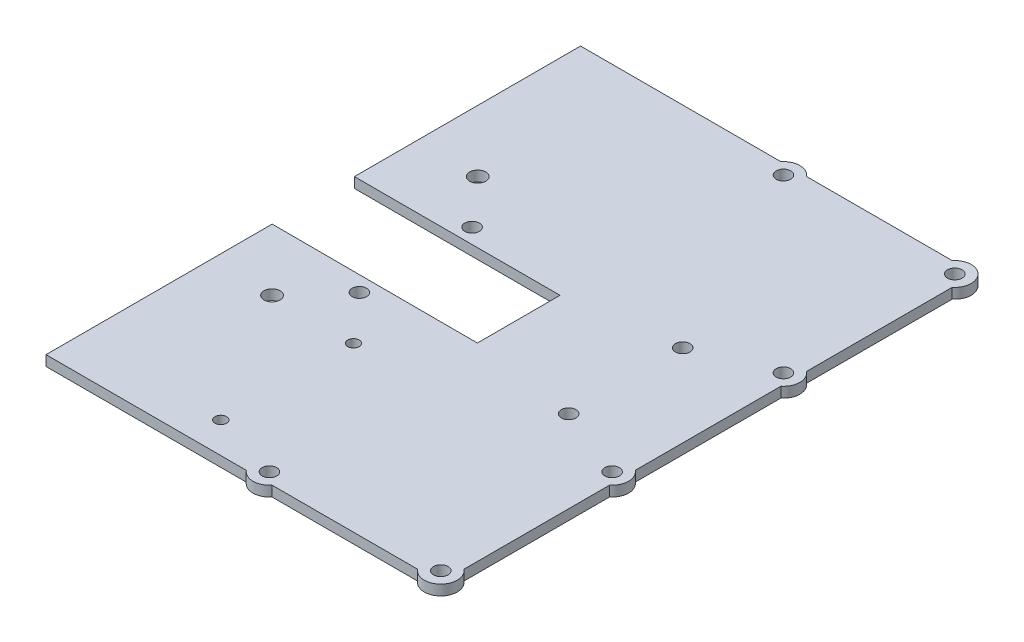
ISO-10303-21;
HEADER;
FILE_DESCRIPTION(('STEP AP214'),'2;1');
FILE_NAME('part.step','',(''),(''),'','','');
FILE_SCHEMA(('AUTOMOTIVE_DESIGN { 1 0 10303 214 1 1 1 1 }'));
ENDSEC;
DATA;
#1=APPLICATION_CONTEXT('core data for automotive mechanical design processes');
#2=APPLICATION_PROTOCOL_DEFINITION('international standard','automotive_design',2000,#1);
#3=PRODUCT_CONTEXT('',#1,'mechanical');
#4=PRODUCT('Part','Part','',(#3));
#5=PRODUCT_RELATED_PRODUCT_CATEGORY('part','',(#4));
#6=PRODUCT_DEFINITION_FORMATION('','',#4);
#7=PRODUCT_DEFINITION_CONTEXT('part definition',#1,'design');
#8=PRODUCT_DEFINITION('design','',#6,#7);
#9=PRODUCT_DEFINITION_SHAPE('','',#8);
#10=(LENGTH_UNIT() NAMED_UNIT(*) SI_UNIT(.MILLI.,.METRE.));
#11=(NAMED_UNIT(*) PLANE_ANGLE_UNIT() SI_UNIT($,.RADIAN.));
#12=(NAMED_UNIT(*) SI_UNIT($,.STERADIAN.) SOLID_ANGLE_UNIT());
#13=UNCERTAINTY_MEASURE_WITH_UNIT(LENGTH_MEASURE(1.E-05),#10,'distance_accuracy_value','');
#14=(GEOMETRIC_REPRESENTATION_CONTEXT(3) GLOBAL_UNCERTAINTY_ASSIGNED_CONTEXT((#13)) GLOBAL_UNIT_ASSIGNED_CONTEXT((#10,
#11,#12)) REPRESENTATION_CONTEXT('',''));
#15=CARTESIAN_POINT('',(0.,0.,0.));
#16=DIRECTION('',(0.,0.,1.));
#17=DIRECTION('',(1.,0.,0.));
#18=AXIS2_PLACEMENT_3D('',#15,#16,#17);
#19=CARTESIAN_POINT('',(65.8400835330666,3.175,-161.924999999998));
#20=DIRECTION('',(0.,1.,0.));
#21=DIRECTION('',(0.,0.,1.));
#22=AXIS2_PLACEMENT_3D('',#19,#20,#21);
#23=PLANE('',#22);
#24=CARTESIAN_POINT('',(44.4499999999973,3.175,-9.52499999999636));
#25=DIRECTION('',(0.,1.,0.));
#26=DIRECTION('',(0.,0.,1.));
#27=AXIS2_PLACEMENT_3D('',#24,#25,#26);
#28=CIRCLE('',#27,1.778);
#29=CARTESIAN_POINT('',(44.4499999999973,3.175,-7.74699999999636));
#30=VERTEX_POINT('',#29);
#31=EDGE_CURVE('E407',#30,#30,#28,.T.);
#32=ORIENTED_EDGE('',*,*,#31,.F.);
#33=EDGE_LOOP('',(#32));
#34=FACE_BOUND('',#33,.T.);
#35=CARTESIAN_POINT('',(44.4499999999973,3.175,-50.5249999999964));
#36=DIRECTION('',(0.,1.,0.));
#37=DIRECTION('',(0.,0.,1.));
#38=AXIS2_PLACEMENT_3D('',#35,#36,#37);
#39=CIRCLE('',#38,1.778);
#40=CARTESIAN_POINT('',(44.4499999999973,3.175,-48.7469999999964));
#41=VERTEX_POINT('',#40);
#42=EDGE_CURVE('E413',#41,#41,#39,.T.);
#43=ORIENTED_EDGE('',*,*,#42,.F.);
#44=EDGE_LOOP('',(#43));
#45=FACE_BOUND('',#44,.T.);
#46=CARTESIAN_POINT('',(19.0500000000007,3.175,-50.7623104410774));
#47=DIRECTION('',(0.,-1.,0.));
#48=DIRECTION('',(0.,0.,-1.));
#49=AXIS2_PLACEMENT_3D('',#46,#47,#48);
#50=CIRCLE('',#49,2.4892);
#51=CARTESIAN_POINT('',(19.0500000000007,3.175,-53.2515104410774));
#52=VERTEX_POINT('',#51);
#53=EDGE_CURVE('E418',#52,#52,#50,.T.);
#54=ORIENTED_EDGE('',*,*,#53,.T.);
#55=EDGE_LOOP('',(#54));
#56=FACE_BOUND('',#55,.T.);
#57=CARTESIAN_POINT('',(31.7125648814911,3.175,-99.8815181228258));
#58=DIRECTION('',(0.,-1.,0.));
#59=DIRECTION('',(0.,0.,1.));
#60=AXIS2_PLACEMENT_3D('',#57,#58,#59);
#61=CIRCLE('',#60,2.24789999999828);
#62=CARTESIAN_POINT('',(31.7125648814911,3.175,-97.6336181228275));
#63=VERTEX_POINT('',#62);
#64=EDGE_CURVE('E426',#63,#63,#61,.T.);
#65=ORIENTED_EDGE('',*,*,#64,.T.);
#66=EDGE_LOOP('',(#65));
#67=FACE_BOUND('',#66,.T.);
#68=CARTESIAN_POINT('',(96.4938906171344,3.175,-100.14870611994));
#69=DIRECTION('',(0.,-1.,0.));
#70=DIRECTION('',(0.,0.,1.));
#71=AXIS2_PLACEMENT_3D('',#68,#69,#70);
#72=CIRCLE('',#71,2.24789999999714);
#73=CARTESIAN_POINT('',(96.4938906171344,3.175,-97.9008061199425));
#74=VERTEX_POINT('',#73);
#75=EDGE_CURVE('E449',#74,#74,#72,.T.);
#76=ORIENTED_EDGE('',*,*,#75,.T.);
#77=EDGE_LOOP('',(#76));
#78=FACE_BOUND('',#77,.T.);
#79=CARTESIAN_POINT('',(96.5317501997383,3.175,-64.8966955716288));
#80=DIRECTION('',(0.,-1.,0.));
#81=DIRECTION('',(0.,0.,-1.));
#82=AXIS2_PLACEMENT_3D('',#79,#80,#81);
#83=CIRCLE('',#82,2.24789999999783);
#84=CARTESIAN_POINT('',(96.5317501997383,3.175,-67.1445955716266));
#85=VERTEX_POINT('',#84);
#86=EDGE_CURVE('E443',#85,#85,#83,.T.);
#87=ORIENTED_EDGE('',*,*,#86,.T.);
#88=EDGE_LOOP('',(#87));
#89=FACE_BOUND('',#88,.T.);
#90=CARTESIAN_POINT('',(31.7499999999973,3.175,-65.0247367825173));
#91=DIRECTION('',(0.,-1.,0.));
#92=DIRECTION('',(0.,0.,-1.));
#93=AXIS2_PLACEMENT_3D('',#90,#91,#92);
#94=CIRCLE('',#93,2.2479000000014);
#95=CARTESIAN_POINT('',(31.7499999999973,3.175,-67.2726367825186));
#96=VERTEX_POINT('',#95);
#97=EDGE_CURVE('E437',#96,#96,#94,.T.);
#98=ORIENTED_EDGE('',*,*,#97,.T.);
#99=EDGE_LOOP('',(#98));
#100=FACE_BOUND('',#99,.T.);
#101=CARTESIAN_POINT('',(19.0500000000007,3.175,-114.3));
#102=DIRECTION('',(0.,-1.,0.));
#103=DIRECTION('',(0.,0.,-1.));
#104=AXIS2_PLACEMENT_3D('',#101,#102,#103);
#105=CIRCLE('',#104,2.4892);
#106=CARTESIAN_POINT('',(19.0500000000007,3.175,-116.7892));
#107=VERTEX_POINT('',#106);
#108=EDGE_CURVE('E425',#107,#107,#105,.T.);
#109=ORIENTED_EDGE('',*,*,#108,.T.);
#110=EDGE_LOOP('',(#109));
#111=FACE_BOUND('',#110,.T.);
#112=CARTESIAN_POINT('',(118.756750199738,3.175,-161.925000000001));
#113=DIRECTION('',(0.,1.,0.));
#114=DIRECTION('',(0.,0.,1.));
#115=AXIS2_PLACEMENT_3D('',#112,#113,#114);
#116=CIRCLE('',#115,2.24789999999733);
#117=CARTESIAN_POINT('',(118.756750199738,3.175,-159.677100000004));
#118=VERTEX_POINT('',#117);
#119=EDGE_CURVE('E460',#118,#118,#116,.T.);
#120=ORIENTED_EDGE('',*,*,#119,.F.);
#121=EDGE_LOOP('',(#120));
#122=FACE_BOUND('',#121,.T.);
#123=CARTESIAN_POINT('',(118.756750199738,3.175,-56.0916666666683));
#124=DIRECTION('',(0.,1.,0.));
#125=DIRECTION('',(0.,0.,1.));
#126=AXIS2_PLACEMENT_3D('',#123,#124,#125);
#127=CIRCLE('',#126,2.24789999999739);
#128=CARTESIAN_POINT('',(118.756750199738,3.175,-53.8437666666709));
#129=VERTEX_POINT('',#128);
#130=EDGE_CURVE('E472',#129,#129,#127,.T.);
#131=ORIENTED_EDGE('',*,*,#130,.F.);
#132=EDGE_LOOP('',(#131));
#133=FACE_BOUND('',#132,.T.);
#134=CARTESIAN_POINT('',(65.8400835330673,3.175,-3.17500000000227));
#135=DIRECTION('',(0.,1.,0.));
#136=DIRECTION('',(0.,0.,1.));
#137=AXIS2_PLACEMENT_3D('',#134,#135,#136);
#138=CIRCLE('',#137,2.2479);
#139=CARTESIAN_POINT('',(65.8400835330673,3.175,-0.927100000002264));
#140=VERTEX_POINT('',#139);
#141=EDGE_CURVE('E197',#140,#140,#138,.T.);
#142=ORIENTED_EDGE('',*,*,#141,.F.);
#143=EDGE_LOOP('',(#142));
#144=FACE_BOUND('',#143,.T.);
#145=CARTESIAN_POINT('',(65.8400835330666,3.175,-161.924999999998));
#146=DIRECTION('',(0.,1.,0.));
#147=DIRECTION('',(0.,0.,1.));
#148=AXIS2_PLACEMENT_3D('',#145,#146,#147);
#149=CIRCLE('',#148,5.08000000000057);
#150=CARTESIAN_POINT('',(69.8056572620526,3.175,-165.099999999995));
#151=VERTEX_POINT('',#150);
#152=CARTESIAN_POINT('',(61.8745098040848,3.175,-165.100000000001));
#153=VERTEX_POINT('',#152);
#154=EDGE_CURVE('E228',#151,#153,#149,.T.);
#155=ORIENTED_EDGE('',*,*,#154,.T.);
#156=DIRECTION('',(-1.,0.,0.));
#157=VECTOR('',#156,1.);
#158=CARTESIAN_POINT('',(1.16573417585641E-12,3.175,-165.1));
#159=LINE('',#158,#157);
#160=CARTESIAN_POINT('',(1.16573417585641E-12,3.175,-165.1));
#161=VERTEX_POINT('',#160);
#162=EDGE_CURVE('E126',#153,#161,#159,.T.);
#163=ORIENTED_EDGE('',*,*,#162,.T.);
#164=DIRECTION('',(0.,0.,1.));
#165=VECTOR('',#164,1.);
#166=CARTESIAN_POINT('',(1.1518563880486E-12,3.175,-95.2500000000001));
#167=LINE('',#166,#165);
#168=CARTESIAN_POINT('',(1.1518563880486E-12,3.175,-95.2500000000001));
#169=VERTEX_POINT('',#168);
#170=EDGE_CURVE('E273',#161,#169,#167,.T.);
#171=ORIENTED_EDGE('',*,*,#170,.T.);
#172=DIRECTION('',(1.,0.,0.));
#173=VECTOR('',#172,1.);
#174=CARTESIAN_POINT('',(1.1518563880486E-12,3.175,-95.2500000000001));
#175=LINE('',#174,#173);
#176=CARTESIAN_POINT('',(63.5000000000023,3.175,-95.2499999999995));
#177=VERTEX_POINT('',#176);
#178=EDGE_CURVE('E292',#169,#177,#175,.T.);
#179=ORIENTED_EDGE('',*,*,#178,.T.);
#180=DIRECTION('',(0.,0.,1.));
#181=VECTOR('',#180,1.);
#182=CARTESIAN_POINT('',(63.5000000000023,3.175,-95.2499999999995));
#183=LINE('',#182,#181);
#184=CARTESIAN_POINT('',(63.5000000000023,3.175,-69.7244921699957));
#185=VERTEX_POINT('',#184);
#186=EDGE_CURVE('E289',#177,#185,#183,.T.);
#187=ORIENTED_EDGE('',*,*,#186,.T.);
#188=DIRECTION('',(-0.999998046727108,0.,-0.00197649739925585));
#189=VECTOR('',#188,1.);
#190=CARTESIAN_POINT('',(63.5000000000023,3.175,-69.7244921699957));
#191=LINE('',#190,#189);
#192=CARTESIAN_POINT('',(-2.692290834716E-12,3.175,-69.8499999999995));
#193=VERTEX_POINT('',#192);
#194=EDGE_CURVE('E291',#185,#193,#191,.T.);
#195=ORIENTED_EDGE('',*,*,#194,.T.);
#196=DIRECTION('',(0.,0.,1.));
#197=VECTOR('',#196,1.);
#198=CARTESIAN_POINT('',(-2.692290834716E-12,3.175,-69.8499999999995));
#199=LINE('',#198,#197);
#200=CARTESIAN_POINT('',(-2.692290834716E-12,3.175,8.40993941153556E-12));
#201=VERTEX_POINT('',#200);
#202=EDGE_CURVE('E294',#193,#201,#199,.T.);
#203=ORIENTED_EDGE('',*,*,#202,.T.);
#204=DIRECTION('',(1.,0.,0.));
#205=VECTOR('',#204,1.);
#206=CARTESIAN_POINT('',(61.8745098040853,3.175,8.38218383591993E-12));
#207=LINE('',#206,#205);
#208=CARTESIAN_POINT('',(61.8745098040853,3.175,8.37958175070597E-12));
#209=VERTEX_POINT('',#208);
#210=EDGE_CURVE('E300',#201,#209,#207,.T.);
#211=ORIENTED_EDGE('',*,*,#210,.T.);
#212=CARTESIAN_POINT('',(65.8400835330662,3.175,-3.17499999999518));
#213=DIRECTION('',(0.,1.,0.));
#214=DIRECTION('',(0.,0.,1.));
#215=AXIS2_PLACEMENT_3D('',#212,#213,#214);
#216=CIRCLE('',#215,5.08000000000054);
#217=CARTESIAN_POINT('',(69.8056572620498,3.175,4.8017145815038E-12));
#218=VERTEX_POINT('',#217);
#219=EDGE_CURVE('E302',#209,#218,#216,.T.);
#220=ORIENTED_EDGE('',*,*,#219,.T.);
#221=DIRECTION('',(1.,0.,0.));
#222=VECTOR('',#221,1.);
#223=CARTESIAN_POINT('',(114.791176470752,3.175,4.8017145815038E-12));
#224=LINE('',#223,#222);
#225=CARTESIAN_POINT('',(114.791176470752,3.175,4.80865347540771E-12));
#226=VERTEX_POINT('',#225);
#227=EDGE_CURVE('E304',#218,#226,#224,.T.);
#228=ORIENTED_EDGE('',*,*,#227,.T.);
#229=CARTESIAN_POINT('',(118.756750199734,3.175,-3.17499999999604));
#230=DIRECTION('',(0.,1.,0.));
#231=DIRECTION('',(0.,0.,1.));
#232=AXIS2_PLACEMENT_3D('',#229,#230,#231);
#233=CIRCLE('',#232,5.07999999999957);
#234=CARTESIAN_POINT('',(121.931750199738,3.175,-7.14057372897531));
#235=VERTEX_POINT('',#234);
#236=EDGE_CURVE('E306',#226,#235,#233,.T.);
#237=ORIENTED_EDGE('',*,*,#236,.T.);
#238=DIRECTION('',(0.,0.,-1.));
#239=VECTOR('',#238,1.);
#240=CARTESIAN_POINT('',(121.931750199738,3.175,-52.1260929376767));
#241=LINE('',#240,#239);
#242=CARTESIAN_POINT('',(121.931750199738,3.175,-52.1260929376767));
#243=VERTEX_POINT('',#242);
#244=EDGE_CURVE('E308',#235,#243,#241,.T.);
#245=ORIENTED_EDGE('',*,*,#244,.T.);
#246=CARTESIAN_POINT('',(118.756750199735,3.175,-56.0916666666599));
#247=DIRECTION('',(0.,1.,0.));
#248=DIRECTION('',(0.,0.,1.));
#249=AXIS2_PLACEMENT_3D('',#246,#247,#248);
#250=CIRCLE('',#249,5.08000000000181);
#251=CARTESIAN_POINT('',(121.931750199738,3.175,-60.0572403956426));
#252=VERTEX_POINT('',#251);
#253=EDGE_CURVE('E310',#243,#252,#250,.T.);
#254=ORIENTED_EDGE('',*,*,#253,.T.);
#255=DIRECTION('',(0.,0.,-1.));
#256=VECTOR('',#255,1.);
#257=CARTESIAN_POINT('',(121.931750199738,3.175,-105.042759604344));
#258=LINE('',#257,#256);
#259=CARTESIAN_POINT('',(121.931750199738,3.175,-105.042759604344));
#260=VERTEX_POINT('',#259);
#261=EDGE_CURVE('E312',#252,#260,#258,.T.);
#262=ORIENTED_EDGE('',*,*,#261,.T.);
#263=CARTESIAN_POINT('',(118.756750199735,3.175,-109.008333333327));
#264=DIRECTION('',(0.,1.,0.));
#265=DIRECTION('',(0.,0.,1.));
#266=AXIS2_PLACEMENT_3D('',#263,#264,#265);
#267=CIRCLE('',#266,5.08000000000218);
#268=CARTESIAN_POINT('',(121.931750199738,3.175,-112.97390706231));
#269=VERTEX_POINT('',#268);
#270=EDGE_CURVE('E175',#260,#269,#267,.T.);
#271=ORIENTED_EDGE('',*,*,#270,.T.);
#272=DIRECTION('',(0.,0.,-1.));
#273=VECTOR('',#272,1.);
#274=CARTESIAN_POINT('',(121.931750199738,3.175,-157.959426271011));
#275=LINE('',#274,#273);
#276=CARTESIAN_POINT('',(121.931750199738,3.175,-157.959426271011));
#277=VERTEX_POINT('',#276);
#278=EDGE_CURVE('E169',#269,#277,#275,.T.);
#279=ORIENTED_EDGE('',*,*,#278,.T.);
#280=CARTESIAN_POINT('',(118.756750199735,3.175,-161.924999999993));
#281=DIRECTION('',(0.,1.,0.));
#282=DIRECTION('',(0.,0.,1.));
#283=AXIS2_PLACEMENT_3D('',#280,#281,#282);
#284=CIRCLE('',#283,5.08000000000099);
#285=CARTESIAN_POINT('',(114.791176470752,3.175,-165.099999999995));
#286=VERTEX_POINT('',#285);
#287=EDGE_CURVE('E173',#277,#286,#284,.T.);
#288=ORIENTED_EDGE('',*,*,#287,.T.);
#289=DIRECTION('',(-1.,0.,0.));
#290=VECTOR('',#289,1.);
#291=CARTESIAN_POINT('',(69.8056572620526,3.175,-165.099999999995));
#292=LINE('',#291,#290);
#293=EDGE_CURVE('E53',#286,#151,#292,.T.);
#294=ORIENTED_EDGE('',*,*,#293,.T.);
#295=EDGE_LOOP('',(#155,#163,#171,#179,#187,#195,#203,#211,#220,#228,#237,#245,#254,#262,#271,
#279,#288,#294));
#296=FACE_BOUND('',#295,.T.);
#297=CARTESIAN_POINT('',(118.756750199736,3.175,-3.17500000000447));
#298=DIRECTION('',(0.,1.,0.));
#299=DIRECTION('',(0.,0.,1.));
#300=AXIS2_PLACEMENT_3D('',#297,#298,#299);
#301=CIRCLE('',#300,2.24789999999743);
#302=CARTESIAN_POINT('',(118.756750199736,3.175,-0.927100000007042));
#303=VERTEX_POINT('',#302);
#304=EDGE_CURVE('E478',#303,#303,#301,.T.);
#305=ORIENTED_EDGE('',*,*,#304,.F.);
#306=EDGE_LOOP('',(#305));
#307=FACE_BOUND('',#306,.T.);
#308=CARTESIAN_POINT('',(118.756750199737,3.175,-109.008333333335));
#309=DIRECTION('',(0.,1.,0.));
#310=DIRECTION('',(0.,0.,1.));
#311=AXIS2_PLACEMENT_3D('',#308,#309,#310);
#312=CIRCLE('',#311,2.24789999999737);
#313=CARTESIAN_POINT('',(118.756750199737,3.175,-106.760433333338));
#314=VERTEX_POINT('',#313);
#315=EDGE_CURVE('E466',#314,#314,#312,.T.);
#316=ORIENTED_EDGE('',*,*,#315,.F.);
#317=EDGE_LOOP('',(#316));
#318=FACE_BOUND('',#317,.T.);
#319=CARTESIAN_POINT('',(65.8400835330693,3.175,-161.925000000007));
#320=DIRECTION('',(0.,1.,0.));
#321=DIRECTION('',(0.,0.,1.));
#322=AXIS2_PLACEMENT_3D('',#319,#320,#321);
#323=CIRCLE('',#322,2.24789999999687);
#324=CARTESIAN_POINT('',(65.8400835330693,3.175,-159.67710000001));
#325=VERTEX_POINT('',#324);
#326=EDGE_CURVE('E454',#325,#325,#323,.T.);
#327=ORIENTED_EDGE('',*,*,#326,.F.);
#328=EDGE_LOOP('',(#327));
#329=FACE_BOUND('',#328,.T.);
#330=ADVANCED_FACE('F36',(#34,#45,#56,#67,#78,#89,#100,#111,#122,#133,#144,#296,#307,#318,#329),
#23,.T.);
#331=CARTESIAN_POINT('',(65.8400835330666,0.,-161.924999999998));
#332=DIRECTION('',(0.,1.,0.));
#333=DIRECTION('',(0.,0.,1.));
#334=AXIS2_PLACEMENT_3D('',#331,#332,#333);
#335=PLANE('',#334);
#336=CARTESIAN_POINT('',(44.4499999999973,0.,-9.52499999999636));
#337=DIRECTION('',(0.,1.,0.));
#338=DIRECTION('',(0.,0.,1.));
#339=AXIS2_PLACEMENT_3D('',#336,#337,#338);
#340=CIRCLE('',#339,1.778);
#341=CARTESIAN_POINT('',(44.4499999999973,0.,-7.74699999999636));
#342=VERTEX_POINT('',#341);
#343=EDGE_CURVE('E405',#342,#342,#340,.T.);
#344=ORIENTED_EDGE('',*,*,#343,.T.);
#345=EDGE_LOOP('',(#344));
#346=FACE_BOUND('',#345,.T.);
#347=CARTESIAN_POINT('',(44.4499999999973,0.,-50.5249999999964));
#348=DIRECTION('',(0.,1.,0.));
#349=DIRECTION('',(0.,0.,1.));
#350=AXIS2_PLACEMENT_3D('',#347,#348,#349);
#351=CIRCLE('',#350,1.778);
#352=CARTESIAN_POINT('',(44.4499999999973,0.,-48.7469999999964));
#353=VERTEX_POINT('',#352);
#354=EDGE_CURVE('E408',#353,#353,#351,.T.);
#355=ORIENTED_EDGE('',*,*,#354,.T.);
#356=EDGE_LOOP('',(#355));
#357=FACE_BOUND('',#356,.T.);
#358=CARTESIAN_POINT('',(19.0500000000007,0.,-50.7623104410774));
#359=DIRECTION('',(0.,-1.,0.));
#360=DIRECTION('',(0.,0.,-1.));
#361=AXIS2_PLACEMENT_3D('',#358,#359,#360);
#362=CIRCLE('',#361,2.4892);
#363=CARTESIAN_POINT('',(19.0500000000007,0.,-53.2515104410774));
#364=VERTEX_POINT('',#363);
#365=EDGE_CURVE('E422',#364,#364,#362,.T.);
#366=ORIENTED_EDGE('',*,*,#365,.F.);
#367=EDGE_LOOP('',(#366));
#368=FACE_BOUND('',#367,.T.);
#369=CARTESIAN_POINT('',(31.7125648814911,0.,-99.8815181228258));
#370=DIRECTION('',(0.,-1.,0.));
#371=DIRECTION('',(0.,0.,1.));
#372=AXIS2_PLACEMENT_3D('',#369,#370,#371);
#373=CIRCLE('',#372,2.24789999999828);
#374=CARTESIAN_POINT('',(31.7125648814911,0.,-97.6336181228275));
#375=VERTEX_POINT('',#374);
#376=EDGE_CURVE('E410',#375,#375,#373,.T.);
#377=ORIENTED_EDGE('',*,*,#376,.F.);
#378=EDGE_LOOP('',(#377));
#379=FACE_BOUND('',#378,.T.);
#380=CARTESIAN_POINT('',(96.4938906171344,0.,-100.14870611994));
#381=DIRECTION('',(0.,-1.,0.));
#382=DIRECTION('',(0.,0.,1.));
#383=AXIS2_PLACEMENT_3D('',#380,#381,#382);
#384=CIRCLE('',#383,2.24789999999714);
#385=CARTESIAN_POINT('',(96.4938906171344,0.,-97.9008061199425));
#386=VERTEX_POINT('',#385);
#387=EDGE_CURVE('E429',#386,#386,#384,.T.);
#388=ORIENTED_EDGE('',*,*,#387,.F.);
#389=EDGE_LOOP('',(#388));
#390=FACE_BOUND('',#389,.T.);
#391=CARTESIAN_POINT('',(96.5317501997383,0.,-64.8966955716288));
#392=DIRECTION('',(0.,-1.,0.));
#393=DIRECTION('',(0.,0.,-1.));
#394=AXIS2_PLACEMENT_3D('',#391,#392,#393);
#395=CIRCLE('',#394,2.24789999999783);
#396=CARTESIAN_POINT('',(96.5317501997383,0.,-67.1445955716266));
#397=VERTEX_POINT('',#396);
#398=EDGE_CURVE('E446',#397,#397,#395,.T.);
#399=ORIENTED_EDGE('',*,*,#398,.F.);
#400=EDGE_LOOP('',(#399));
#401=FACE_BOUND('',#400,.T.);
#402=CARTESIAN_POINT('',(31.7499999999973,0.,-65.0247367825173));
#403=DIRECTION('',(0.,-1.,0.));
#404=DIRECTION('',(0.,0.,-1.));
#405=AXIS2_PLACEMENT_3D('',#402,#403,#404);
#406=CIRCLE('',#405,2.2479000000014);
#407=CARTESIAN_POINT('',(31.7499999999973,0.,-67.2726367825186));
#408=VERTEX_POINT('',#407);
#409=EDGE_CURVE('E440',#408,#408,#406,.T.);
#410=ORIENTED_EDGE('',*,*,#409,.F.);
#411=EDGE_LOOP('',(#410));
#412=FACE_BOUND('',#411,.T.);
#413=CARTESIAN_POINT('',(19.0500000000007,0.,-114.3));
#414=DIRECTION('',(0.,-1.,0.));
#415=DIRECTION('',(0.,0.,-1.));
#416=AXIS2_PLACEMENT_3D('',#413,#414,#415);
#417=CIRCLE('',#416,2.4892);
#418=CARTESIAN_POINT('',(19.0500000000007,0.,-116.7892));
#419=VERTEX_POINT('',#418);
#420=EDGE_CURVE('E434',#419,#419,#417,.T.);
#421=ORIENTED_EDGE('',*,*,#420,.F.);
#422=EDGE_LOOP('',(#421));
#423=FACE_BOUND('',#422,.T.);
#424=CARTESIAN_POINT('',(65.8400835330666,0.,-161.924999999998));
#425=DIRECTION('',(0.,1.,0.));
#426=DIRECTION('',(0.,0.,1.));
#427=AXIS2_PLACEMENT_3D('',#424,#425,#426);
#428=CIRCLE('',#427,5.08000000000057);
#429=CARTESIAN_POINT('',(69.8056572620526,0.,-165.099999999995));
#430=VERTEX_POINT('',#429);
#431=CARTESIAN_POINT('',(61.8745098040848,0.,-165.100000000001));
#432=VERTEX_POINT('',#431);
#433=EDGE_CURVE('E193',#430,#432,#428,.T.);
#434=ORIENTED_EDGE('',*,*,#433,.F.);
#435=DIRECTION('',(-1.,0.,0.));
#436=VECTOR('',#435,1.);
#437=CARTESIAN_POINT('',(69.8056572620526,0.,-165.099999999995));
#438=LINE('',#437,#436);
#439=CARTESIAN_POINT('',(114.791176470752,0.,-165.099999999995));
#440=VERTEX_POINT('',#439);
#441=EDGE_CURVE('E118',#440,#430,#438,.T.);
#442=ORIENTED_EDGE('',*,*,#441,.F.);
#443=CARTESIAN_POINT('',(118.756750199735,0.,-161.924999999993));
#444=DIRECTION('',(0.,1.,0.));
#445=DIRECTION('',(0.,0.,1.));
#446=AXIS2_PLACEMENT_3D('',#443,#444,#445);
#447=CIRCLE('',#446,5.08000000000099);
#448=CARTESIAN_POINT('',(121.931750199738,0.,-157.959426271011));
#449=VERTEX_POINT('',#448);
#450=EDGE_CURVE('E112',#449,#440,#447,.T.);
#451=ORIENTED_EDGE('',*,*,#450,.F.);
#452=DIRECTION('',(0.,0.,-1.));
#453=VECTOR('',#452,1.);
#454=CARTESIAN_POINT('',(121.931750199738,0.,-157.959426271011));
#455=LINE('',#454,#453);
#456=CARTESIAN_POINT('',(121.931750199738,0.,-112.97390706231));
#457=VERTEX_POINT('',#456);
#458=EDGE_CURVE('E183',#457,#449,#455,.T.);
#459=ORIENTED_EDGE('',*,*,#458,.F.);
#460=CARTESIAN_POINT('',(118.756750199735,0.,-109.008333333327));
#461=DIRECTION('',(0.,1.,0.));
#462=DIRECTION('',(0.,0.,1.));
#463=AXIS2_PLACEMENT_3D('',#460,#461,#462);
#464=CIRCLE('',#463,5.08000000000218);
#465=CARTESIAN_POINT('',(121.931750199738,0.,-105.042759604344));
#466=VERTEX_POINT('',#465);
#467=EDGE_CURVE('E223',#466,#457,#464,.T.);
#468=ORIENTED_EDGE('',*,*,#467,.F.);
#469=DIRECTION('',(0.,0.,-1.));
#470=VECTOR('',#469,1.);
#471=CARTESIAN_POINT('',(121.931750199738,0.,-105.042759604344));
#472=LINE('',#471,#470);
#473=CARTESIAN_POINT('',(121.931750199738,0.,-60.0572403956426));
#474=VERTEX_POINT('',#473);
#475=EDGE_CURVE('E221',#474,#466,#472,.T.);
#476=ORIENTED_EDGE('',*,*,#475,.F.);
#477=CARTESIAN_POINT('',(118.756750199735,0.,-56.0916666666599));
#478=DIRECTION('',(0.,1.,0.));
#479=DIRECTION('',(0.,0.,1.));
#480=AXIS2_PLACEMENT_3D('',#477,#478,#479);
#481=CIRCLE('',#480,5.08000000000181);
#482=CARTESIAN_POINT('',(121.931750199738,0.,-52.1260929376767));
#483=VERTEX_POINT('',#482);
#484=EDGE_CURVE('E219',#483,#474,#481,.T.);
#485=ORIENTED_EDGE('',*,*,#484,.F.);
#486=DIRECTION('',(0.,0.,-1.));
#487=VECTOR('',#486,1.);
#488=CARTESIAN_POINT('',(121.931750199738,0.,-52.1260929376767));
#489=LINE('',#488,#487);
#490=CARTESIAN_POINT('',(121.931750199738,0.,-7.14057372897531));
#491=VERTEX_POINT('',#490);
#492=EDGE_CURVE('E217',#491,#483,#489,.T.);
#493=ORIENTED_EDGE('',*,*,#492,.F.);
#494=CARTESIAN_POINT('',(118.756750199734,0.,-3.17499999999604));
#495=DIRECTION('',(0.,1.,0.));
#496=DIRECTION('',(0.,0.,1.));
#497=AXIS2_PLACEMENT_3D('',#494,#495,#496);
#498=CIRCLE('',#497,5.07999999999957);
#499=CARTESIAN_POINT('',(114.791176470752,0.,4.80865347540771E-12));
#500=VERTEX_POINT('',#499);
#501=EDGE_CURVE('E215',#500,#491,#498,.T.);
#502=ORIENTED_EDGE('',*,*,#501,.F.);
#503=DIRECTION('',(1.,0.,0.));
#504=VECTOR('',#503,1.);
#505=CARTESIAN_POINT('',(114.791176470752,0.,4.8017145815038E-12));
#506=LINE('',#505,#504);
#507=CARTESIAN_POINT('',(69.8056572620498,0.,4.8017145815038E-12));
#508=VERTEX_POINT('',#507);
#509=EDGE_CURVE('E213',#508,#500,#506,.T.);
#510=ORIENTED_EDGE('',*,*,#509,.F.);
#511=CARTESIAN_POINT('',(65.8400835330662,0.,-3.17499999999518));
#512=DIRECTION('',(0.,1.,0.));
#513=DIRECTION('',(0.,0.,1.));
#514=AXIS2_PLACEMENT_3D('',#511,#512,#513);
#515=CIRCLE('',#514,5.08000000000054);
#516=CARTESIAN_POINT('',(61.8745098040853,0.,8.37958175070597E-12));
#517=VERTEX_POINT('',#516);
#518=EDGE_CURVE('E211',#517,#508,#515,.T.);
#519=ORIENTED_EDGE('',*,*,#518,.F.);
#520=DIRECTION('',(1.,0.,0.));
#521=VECTOR('',#520,1.);
#522=CARTESIAN_POINT('',(61.8745098040853,0.,8.38218383591993E-12));
#523=LINE('',#522,#521);
#524=CARTESIAN_POINT('',(-2.692290834716E-12,0.,8.40993941153556E-12));
#525=VERTEX_POINT('',#524);
#526=EDGE_CURVE('E209',#525,#517,#523,.T.);
#527=ORIENTED_EDGE('',*,*,#526,.F.);
#528=DIRECTION('',(0.,0.,1.));
#529=VECTOR('',#528,1.);
#530=CARTESIAN_POINT('',(-2.692290834716E-12,0.,-69.8499999999995));
#531=LINE('',#530,#529);
#532=CARTESIAN_POINT('',(-2.692290834716E-12,0.,-69.8499999999995));
#533=VERTEX_POINT('',#532);
#534=EDGE_CURVE('E207',#533,#525,#531,.T.);
#535=ORIENTED_EDGE('',*,*,#534,.F.);
#536=DIRECTION('',(-0.999998046727108,0.,-0.00197649739925585));
#537=VECTOR('',#536,1.);
#538=CARTESIAN_POINT('',(63.5000000000023,0.,-69.7244921699957));
#539=LINE('',#538,#537);
#540=CARTESIAN_POINT('',(63.5000000000023,0.,-69.7244921699957));
#541=VERTEX_POINT('',#540);
#542=EDGE_CURVE('E205',#541,#533,#539,.T.);
#543=ORIENTED_EDGE('',*,*,#542,.F.);
#544=DIRECTION('',(0.,0.,1.));
#545=VECTOR('',#544,1.);
#546=CARTESIAN_POINT('',(63.5000000000023,0.,-95.2499999999995));
#547=LINE('',#546,#545);
#548=CARTESIAN_POINT('',(63.5000000000023,0.,-95.2499999999995));
#549=VERTEX_POINT('',#548);
#550=EDGE_CURVE('E203',#549,#541,#547,.T.);
#551=ORIENTED_EDGE('',*,*,#550,.F.);
#552=DIRECTION('',(1.,0.,0.));
#553=VECTOR('',#552,1.);
#554=CARTESIAN_POINT('',(1.1518563880486E-12,0.,-95.2500000000001));
#555=LINE('',#554,#553);
#556=CARTESIAN_POINT('',(1.1518563880486E-12,0.,-95.2500000000001));
#557=VERTEX_POINT('',#556);
#558=EDGE_CURVE('E201',#557,#549,#555,.T.);
#559=ORIENTED_EDGE('',*,*,#558,.F.);
#560=DIRECTION('',(0.,0.,1.));
#561=VECTOR('',#560,1.);
#562=CARTESIAN_POINT('',(1.1518563880486E-12,0.,-95.2500000000001));
#563=LINE('',#562,#561);
#564=CARTESIAN_POINT('',(1.16573417585641E-12,0.,-165.1));
#565=VERTEX_POINT('',#564);
#566=EDGE_CURVE('E199',#565,#557,#563,.T.);
#567=ORIENTED_EDGE('',*,*,#566,.F.);
#568=DIRECTION('',(-1.,0.,0.));
#569=VECTOR('',#568,1.);
#570=CARTESIAN_POINT('',(1.16573417585641E-12,0.,-165.1));
#571=LINE('',#570,#569);
#572=EDGE_CURVE('E196',#432,#565,#571,.T.);
#573=ORIENTED_EDGE('',*,*,#572,.F.);
#574=EDGE_LOOP('',(#434,#442,#451,#459,#468,#476,#485,#493,#502,#510,#519,#527,#535,#543,#551,
#559,#567,#573));
#575=FACE_BOUND('',#574,.T.);
#576=CARTESIAN_POINT('',(65.8400835330673,0.,-3.17500000000227));
#577=DIRECTION('',(0.,1.,0.));
#578=DIRECTION('',(0.,0.,1.));
#579=AXIS2_PLACEMENT_3D('',#576,#577,#578);
#580=CIRCLE('',#579,2.2479);
#581=CARTESIAN_POINT('',(65.8400835330673,0.,-0.927100000002264));
#582=VERTEX_POINT('',#581);
#583=EDGE_CURVE('E481',#582,#582,#580,.T.);
#584=ORIENTED_EDGE('',*,*,#583,.T.);
#585=EDGE_LOOP('',(#584));
#586=FACE_BOUND('',#585,.T.);
#587=CARTESIAN_POINT('',(118.756750199736,0.,-3.17500000000447));
#588=DIRECTION('',(0.,1.,0.));
#589=DIRECTION('',(0.,0.,1.));
#590=AXIS2_PLACEMENT_3D('',#587,#588,#589);
#591=CIRCLE('',#590,2.24789999999743);
#592=CARTESIAN_POINT('',(118.756750199736,0.,-0.927100000007042));
#593=VERTEX_POINT('',#592);
#594=EDGE_CURVE('E475',#593,#593,#591,.T.);
#595=ORIENTED_EDGE('',*,*,#594,.T.);
#596=EDGE_LOOP('',(#595));
#597=FACE_BOUND('',#596,.T.);
#598=CARTESIAN_POINT('',(118.756750199738,0.,-56.0916666666683));
#599=DIRECTION('',(0.,1.,0.));
#600=DIRECTION('',(0.,0.,1.));
#601=AXIS2_PLACEMENT_3D('',#598,#599,#600);
#602=CIRCLE('',#601,2.24789999999739);
#603=CARTESIAN_POINT('',(118.756750199738,0.,-53.8437666666709));
#604=VERTEX_POINT('',#603);
#605=EDGE_CURVE('E469',#604,#604,#602,.T.);
#606=ORIENTED_EDGE('',*,*,#605,.T.);
#607=EDGE_LOOP('',(#606));
#608=FACE_BOUND('',#607,.T.);
#609=CARTESIAN_POINT('',(118.756750199737,0.,-109.008333333335));
#610=DIRECTION('',(0.,1.,0.));
#611=DIRECTION('',(0.,0.,1.));
#612=AXIS2_PLACEMENT_3D('',#609,#610,#611);
#613=CIRCLE('',#612,2.24789999999737);
#614=CARTESIAN_POINT('',(118.756750199737,0.,-106.760433333338));
#615=VERTEX_POINT('',#614);
#616=EDGE_CURVE('E463',#615,#615,#613,.T.);
#617=ORIENTED_EDGE('',*,*,#616,.T.);
#618=EDGE_LOOP('',(#617));
#619=FACE_BOUND('',#618,.T.);
#620=CARTESIAN_POINT('',(118.756750199738,0.,-161.925000000001));
#621=DIRECTION('',(0.,1.,0.));
#622=DIRECTION('',(0.,0.,1.));
#623=AXIS2_PLACEMENT_3D('',#620,#621,#622);
#624=CIRCLE('',#623,2.24789999999733);
#625=CARTESIAN_POINT('',(118.756750199738,0.,-159.677100000004));
#626=VERTEX_POINT('',#625);
#627=EDGE_CURVE('E457',#626,#626,#624,.T.);
#628=ORIENTED_EDGE('',*,*,#627,.T.);
#629=EDGE_LOOP('',(#628));
#630=FACE_BOUND('',#629,.T.);
#631=CARTESIAN_POINT('',(65.8400835330693,0.,-161.925000000007));
#632=DIRECTION('',(0.,1.,0.));
#633=DIRECTION('',(0.,0.,1.));
#634=AXIS2_PLACEMENT_3D('',#631,#632,#633);
#635=CIRCLE('',#634,2.24789999999687);
#636=CARTESIAN_POINT('',(65.8400835330693,0.,-159.67710000001));
#637=VERTEX_POINT('',#636);
#638=EDGE_CURVE('E421',#637,#637,#635,.T.);
#639=ORIENTED_EDGE('',*,*,#638,.T.);
#640=EDGE_LOOP('',(#639));
#641=FACE_BOUND('',#640,.T.);
#642=ADVANCED_FACE('F277',(#346,#357,#368,#379,#390,#401,#412,#423,#575,#586,#597,#608,#619,
#630,#641),#335,.F.);
#643=CARTESIAN_POINT('',(65.8400835330666,3.175,-161.924999999998));
#644=DIRECTION('',(0.,-1.,0.));
#645=DIRECTION('',(0.,0.,-1.));
#646=AXIS2_PLACEMENT_3D('',#643,#644,#645);
#647=CYLINDRICAL_SURFACE('',#646,5.08000000000057);
#648=ORIENTED_EDGE('',*,*,#433,.T.);
#649=DIRECTION('',(0.,-1.,0.));
#650=VECTOR('',#649,1.);
#651=CARTESIAN_POINT('',(61.8745098040848,3.175,-165.100000000001));
#652=LINE('',#651,#650);
#653=EDGE_CURVE('E11',#153,#432,#652,.T.);
#654=ORIENTED_EDGE('',*,*,#653,.F.);
#655=ORIENTED_EDGE('',*,*,#154,.F.);
#656=DIRECTION('',(0.,-1.,0.));
#657=VECTOR('',#656,1.);
#658=CARTESIAN_POINT('',(69.8056572620526,3.175,-165.099999999995));
#659=LINE('',#658,#657);
#660=EDGE_CURVE('E189',#151,#430,#659,.T.);
#661=ORIENTED_EDGE('',*,*,#660,.T.);
#662=EDGE_LOOP('',(#648,#654,#655,#661));
#663=FACE_BOUND('',#662,.T.);
#664=ADVANCED_FACE('F38',(#663),#647,.T.);
#665=CARTESIAN_POINT('',(1.16573417585641E-12,3.175,-165.1));
#666=DIRECTION('',(0.,0.,1.));
#667=DIRECTION('',(1.,0.,0.));
#668=AXIS2_PLACEMENT_3D('',#665,#666,#667);
#669=PLANE('',#668);
#670=ORIENTED_EDGE('',*,*,#572,.T.);
#671=DIRECTION('',(0.,-1.,0.));
#672=VECTOR('',#671,1.);
#673=CARTESIAN_POINT('',(1.16573417585641E-12,3.175,-165.1));
#674=LINE('',#673,#672);
#675=EDGE_CURVE('E45',#161,#565,#674,.T.);
#676=ORIENTED_EDGE('',*,*,#675,.F.);
#677=ORIENTED_EDGE('',*,*,#162,.F.);
#678=ORIENTED_EDGE('',*,*,#653,.T.);
#679=EDGE_LOOP('',(#670,#676,#677,#678));
#680=FACE_BOUND('',#679,.T.);
#681=ADVANCED_FACE('F741',(#680),#669,.F.);
#682=CARTESIAN_POINT('',(1.1518563880486E-12,3.175,-95.2500000000001));
#683=DIRECTION('',(1.,0.,0.));
#684=DIRECTION('',(0.,0.,-1.));
#685=AXIS2_PLACEMENT_3D('',#682,#683,#684);
#686=PLANE('',#685);
#687=ORIENTED_EDGE('',*,*,#566,.T.);
#688=DIRECTION('',(0.,-1.,0.));
#689=VECTOR('',#688,1.);
#690=CARTESIAN_POINT('',(1.1518563880486E-12,3.175,-95.2500000000001));
#691=LINE('',#690,#689);
#692=EDGE_CURVE('E265',#169,#557,#691,.T.);
#693=ORIENTED_EDGE('',*,*,#692,.F.);
#694=ORIENTED_EDGE('',*,*,#170,.F.);
#695=ORIENTED_EDGE('',*,*,#675,.T.);
#696=EDGE_LOOP('',(#687,#693,#694,#695));
#697=FACE_BOUND('',#696,.T.);
#698=ADVANCED_FACE('F271',(#697),#686,.F.);
#699=CARTESIAN_POINT('',(1.1518563880486E-12,3.175,-95.2500000000001));
#700=DIRECTION('',(0.,0.,-1.));
#701=DIRECTION('',(-1.,0.,0.));
#702=AXIS2_PLACEMENT_3D('',#699,#700,#701);
#703=PLANE('',#702);
#704=ORIENTED_EDGE('',*,*,#558,.T.);
#705=DIRECTION('',(0.,-1.,0.));
#706=VECTOR('',#705,1.);
#707=CARTESIAN_POINT('',(63.5000000000023,3.175,-95.2499999999995));
#708=LINE('',#707,#706);
#709=EDGE_CURVE('E262',#177,#549,#708,.T.);
#710=ORIENTED_EDGE('',*,*,#709,.F.);
#711=ORIENTED_EDGE('',*,*,#178,.F.);
#712=ORIENTED_EDGE('',*,*,#692,.T.);
#713=EDGE_LOOP('',(#704,#710,#711,#712));
#714=FACE_BOUND('',#713,.T.);
#715=ADVANCED_FACE('F283',(#714),#703,.F.);
#716=CARTESIAN_POINT('',(63.5000000000023,3.175,-95.2499999999995));
#717=DIRECTION('',(1.,0.,0.));
#718=DIRECTION('',(0.,0.,-1.));
#719=AXIS2_PLACEMENT_3D('',#716,#717,#718);
#720=PLANE('',#719);
#721=ORIENTED_EDGE('',*,*,#550,.T.);
#722=DIRECTION('',(0.,-1.,0.));
#723=VECTOR('',#722,1.);
#724=CARTESIAN_POINT('',(63.5000000000023,3.175,-69.7244921699957));
#725=LINE('',#724,#723);
#726=EDGE_CURVE('E259',#185,#541,#725,.T.);
#727=ORIENTED_EDGE('',*,*,#726,.F.);
#728=ORIENTED_EDGE('',*,*,#186,.F.);
#729=ORIENTED_EDGE('',*,*,#709,.T.);
#730=EDGE_LOOP('',(#721,#727,#728,#729));
#731=FACE_BOUND('',#730,.T.);
#732=ADVANCED_FACE('F287',(#731),#720,.F.);
#733=CARTESIAN_POINT('',(63.5000000000023,3.175,-69.7244921699957));
#734=DIRECTION('',(-0.00197649739925585,0.,0.999998046727108));
#735=DIRECTION('',(0.999998046727108,0.,0.00197649739925585));
#736=AXIS2_PLACEMENT_3D('',#733,#734,#735);
#737=PLANE('',#736);
#738=ORIENTED_EDGE('',*,*,#542,.T.);
#739=DIRECTION('',(0.,-1.,0.));
#740=VECTOR('',#739,1.);
#741=CARTESIAN_POINT('',(-2.692290834716E-12,3.175,-69.8499999999995));
#742=LINE('',#741,#740);
#743=EDGE_CURVE('E256',#193,#533,#742,.T.);
#744=ORIENTED_EDGE('',*,*,#743,.F.);
#745=ORIENTED_EDGE('',*,*,#194,.F.);
#746=ORIENTED_EDGE('',*,*,#726,.T.);
#747=EDGE_LOOP('',(#738,#744,#745,#746));
#748=FACE_BOUND('',#747,.T.);
#749=ADVANCED_FACE('F706',(#748),#737,.F.);
#750=CARTESIAN_POINT('',(-2.692290834716E-12,3.175,-69.8499999999995));
#751=DIRECTION('',(1.,0.,0.));
#752=DIRECTION('',(0.,0.,-1.));
#753=AXIS2_PLACEMENT_3D('',#750,#751,#752);
#754=PLANE('',#753);
#755=ORIENTED_EDGE('',*,*,#534,.T.);
#756=DIRECTION('',(0.,-1.,0.));
#757=VECTOR('',#756,1.);
#758=CARTESIAN_POINT('',(-2.692290834716E-12,3.175,8.40993941153556E-12));
#759=LINE('',#758,#757);
#760=EDGE_CURVE('E253',#201,#525,#759,.T.);
#761=ORIENTED_EDGE('',*,*,#760,.F.);
#762=ORIENTED_EDGE('',*,*,#202,.F.);
#763=ORIENTED_EDGE('',*,*,#743,.T.);
#764=EDGE_LOOP('',(#755,#761,#762,#763));
#765=FACE_BOUND('',#764,.T.);
#766=ADVANCED_FACE('F696',(#765),#754,.F.);
#767=CARTESIAN_POINT('',(61.8745098040853,3.175,8.38218383591993E-12));
#768=DIRECTION('',(0.,0.,-1.));
#769=DIRECTION('',(-1.,0.,0.));
#770=AXIS2_PLACEMENT_3D('',#767,#768,#769);
#771=PLANE('',#770);
#772=ORIENTED_EDGE('',*,*,#526,.T.);
#773=DIRECTION('',(0.,-1.,0.));
#774=VECTOR('',#773,1.);
#775=CARTESIAN_POINT('',(61.8745098040853,3.175,8.37958175070597E-12));
#776=LINE('',#775,#774);
#777=EDGE_CURVE('E250',#209,#517,#776,.T.);
#778=ORIENTED_EDGE('',*,*,#777,.F.);
#779=ORIENTED_EDGE('',*,*,#210,.F.);
#780=ORIENTED_EDGE('',*,*,#760,.T.);
#781=EDGE_LOOP('',(#772,#778,#779,#780));
#782=FACE_BOUND('',#781,.T.);
#783=ADVANCED_FACE('F686',(#782),#771,.F.);
#784=CARTESIAN_POINT('',(65.8400835330662,3.175,-3.17499999999518));
#785=DIRECTION('',(0.,-1.,0.));
#786=DIRECTION('',(0.,0.,-1.));
#787=AXIS2_PLACEMENT_3D('',#784,#785,#786);
#788=CYLINDRICAL_SURFACE('',#787,5.08000000000054);
#789=ORIENTED_EDGE('',*,*,#518,.T.);
#790=DIRECTION('',(0.,-1.,0.));
#791=VECTOR('',#790,1.);
#792=CARTESIAN_POINT('',(69.8056572620498,3.175,4.8017145815038E-12));
#793=LINE('',#792,#791);
#794=EDGE_CURVE('E247',#218,#508,#793,.T.);
#795=ORIENTED_EDGE('',*,*,#794,.F.);
#796=ORIENTED_EDGE('',*,*,#219,.F.);
#797=ORIENTED_EDGE('',*,*,#777,.T.);
#798=EDGE_LOOP('',(#789,#795,#796,#797));
#799=FACE_BOUND('',#798,.T.);
#800=ADVANCED_FACE('F676',(#799),#788,.T.);
#801=CARTESIAN_POINT('',(114.791176470752,3.175,4.8017145815038E-12));
#802=DIRECTION('',(0.,0.,-1.));
#803=DIRECTION('',(-1.,0.,0.));
#804=AXIS2_PLACEMENT_3D('',#801,#802,#803);
#805=PLANE('',#804);
#806=ORIENTED_EDGE('',*,*,#509,.T.);
#807=DIRECTION('',(0.,-1.,0.));
#808=VECTOR('',#807,1.);
#809=CARTESIAN_POINT('',(114.791176470752,3.175,4.80865347540771E-12));
#810=LINE('',#809,#808);
#811=EDGE_CURVE('E244',#226,#500,#810,.T.);
#812=ORIENTED_EDGE('',*,*,#811,.F.);
#813=ORIENTED_EDGE('',*,*,#227,.F.);
#814=ORIENTED_EDGE('',*,*,#794,.T.);
#815=EDGE_LOOP('',(#806,#812,#813,#814));
#816=FACE_BOUND('',#815,.T.);
#817=ADVANCED_FACE('F666',(#816),#805,.F.);
#818=CARTESIAN_POINT('',(118.756750199734,3.175,-3.17499999999604));
#819=DIRECTION('',(0.,-1.,0.));
#820=DIRECTION('',(0.,0.,-1.));
#821=AXIS2_PLACEMENT_3D('',#818,#819,#820);
#822=CYLINDRICAL_SURFACE('',#821,5.07999999999957);
#823=ORIENTED_EDGE('',*,*,#501,.T.);
#824=DIRECTION('',(0.,-1.,0.));
#825=VECTOR('',#824,1.);
#826=CARTESIAN_POINT('',(121.931750199738,3.175,-7.14057372897531));
#827=LINE('',#826,#825);
#828=EDGE_CURVE('E241',#235,#491,#827,.T.);
#829=ORIENTED_EDGE('',*,*,#828,.F.);
#830=ORIENTED_EDGE('',*,*,#236,.F.);
#831=ORIENTED_EDGE('',*,*,#811,.T.);
#832=EDGE_LOOP('',(#823,#829,#830,#831));
#833=FACE_BOUND('',#832,.T.);
#834=ADVANCED_FACE('F656',(#833),#822,.T.);
#835=CARTESIAN_POINT('',(121.931750199738,3.175,-52.1260929376767));
#836=DIRECTION('',(-1.,0.,0.));
#837=DIRECTION('',(0.,0.,1.));
#838=AXIS2_PLACEMENT_3D('',#835,#836,#837);
#839=PLANE('',#838);
#840=ORIENTED_EDGE('',*,*,#492,.T.);
#841=DIRECTION('',(0.,-1.,0.));
#842=VECTOR('',#841,1.);
#843=CARTESIAN_POINT('',(121.931750199738,3.175,-52.1260929376767));
#844=LINE('',#843,#842);
#845=EDGE_CURVE('E238',#243,#483,#844,.T.);
#846=ORIENTED_EDGE('',*,*,#845,.F.);
#847=ORIENTED_EDGE('',*,*,#244,.F.);
#848=ORIENTED_EDGE('',*,*,#828,.T.);
#849=EDGE_LOOP('',(#840,#846,#847,#848));
#850=FACE_BOUND('',#849,.T.);
#851=ADVANCED_FACE('F646',(#850),#839,.F.);
#852=CARTESIAN_POINT('',(118.756750199735,3.175,-56.0916666666599));
#853=DIRECTION('',(0.,-1.,0.));
#854=DIRECTION('',(0.,0.,-1.));
#855=AXIS2_PLACEMENT_3D('',#852,#853,#854);
#856=CYLINDRICAL_SURFACE('',#855,5.08000000000181);
#857=ORIENTED_EDGE('',*,*,#484,.T.);
#858=DIRECTION('',(0.,-1.,0.));
#859=VECTOR('',#858,1.);
#860=CARTESIAN_POINT('',(121.931750199738,3.175,-60.0572403956426));
#861=LINE('',#860,#859);
#862=EDGE_CURVE('E235',#252,#474,#861,.T.);
#863=ORIENTED_EDGE('',*,*,#862,.F.);
#864=ORIENTED_EDGE('',*,*,#253,.F.);
#865=ORIENTED_EDGE('',*,*,#845,.T.);
#866=EDGE_LOOP('',(#857,#863,#864,#865));
#867=FACE_BOUND('',#866,.T.);
#868=ADVANCED_FACE('F637',(#867),#856,.T.);
#869=CARTESIAN_POINT('',(121.931750199738,3.175,-105.042759604344));
#870=DIRECTION('',(-1.,0.,0.));
#871=DIRECTION('',(0.,0.,1.));
#872=AXIS2_PLACEMENT_3D('',#869,#870,#871);
#873=PLANE('',#872);
#874=ORIENTED_EDGE('',*,*,#475,.T.);
#875=DIRECTION('',(0.,-1.,0.));
#876=VECTOR('',#875,1.);
#877=CARTESIAN_POINT('',(121.931750199738,3.175,-105.042759604344));
#878=LINE('',#877,#876);
#879=EDGE_CURVE('E232',#260,#466,#878,.T.);
#880=ORIENTED_EDGE('',*,*,#879,.F.);
#881=ORIENTED_EDGE('',*,*,#261,.F.);
#882=ORIENTED_EDGE('',*,*,#862,.T.);
#883=EDGE_LOOP('',(#874,#880,#881,#882));
#884=FACE_BOUND('',#883,.T.);
#885=ADVANCED_FACE('F318',(#884),#873,.F.);
#886=CARTESIAN_POINT('',(118.756750199735,3.175,-109.008333333327));
#887=DIRECTION('',(0.,-1.,0.));
#888=DIRECTION('',(0.,0.,-1.));
#889=AXIS2_PLACEMENT_3D('',#886,#887,#888);
#890=CYLINDRICAL_SURFACE('',#889,5.08000000000218);
#891=ORIENTED_EDGE('',*,*,#467,.T.);
#892=DIRECTION('',(0.,-1.,0.));
#893=VECTOR('',#892,1.);
#894=CARTESIAN_POINT('',(121.931750199738,3.175,-112.97390706231));
#895=LINE('',#894,#893);
#896=EDGE_CURVE('E184',#269,#457,#895,.T.);
#897=ORIENTED_EDGE('',*,*,#896,.F.);
#898=ORIENTED_EDGE('',*,*,#270,.F.);
#899=ORIENTED_EDGE('',*,*,#879,.T.);
#900=EDGE_LOOP('',(#891,#897,#898,#899));
#901=FACE_BOUND('',#900,.T.);
#902=ADVANCED_FACE('F322',(#901),#890,.T.);
#903=CARTESIAN_POINT('',(121.931750199738,3.175,-157.959426271011));
#904=DIRECTION('',(-1.,0.,0.));
#905=DIRECTION('',(0.,0.,1.));
#906=AXIS2_PLACEMENT_3D('',#903,#904,#905);
#907=PLANE('',#906);
#908=ORIENTED_EDGE('',*,*,#458,.T.);
#909=DIRECTION('',(0.,-1.,0.));
#910=VECTOR('',#909,1.);
#911=CARTESIAN_POINT('',(121.931750199738,3.175,-157.959426271011));
#912=LINE('',#911,#910);
#913=EDGE_CURVE('E180',#277,#449,#912,.T.);
#914=ORIENTED_EDGE('',*,*,#913,.F.);
#915=ORIENTED_EDGE('',*,*,#278,.F.);
#916=ORIENTED_EDGE('',*,*,#896,.T.);
#917=EDGE_LOOP('',(#908,#914,#915,#916));
#918=FACE_BOUND('',#917,.T.);
#919=ADVANCED_FACE('F181',(#918),#907,.F.);
#920=CARTESIAN_POINT('',(118.756750199735,3.175,-161.924999999993));
#921=DIRECTION('',(0.,-1.,0.));
#922=DIRECTION('',(0.,0.,-1.));
#923=AXIS2_PLACEMENT_3D('',#920,#921,#922);
#924=CYLINDRICAL_SURFACE('',#923,5.08000000000099);
#925=ORIENTED_EDGE('',*,*,#450,.T.);
#926=DIRECTION('',(0.,-1.,0.));
#927=VECTOR('',#926,1.);
#928=CARTESIAN_POINT('',(114.791176470752,3.175,-165.099999999995));
#929=LINE('',#928,#927);
#930=EDGE_CURVE('E185',#286,#440,#929,.T.);
#931=ORIENTED_EDGE('',*,*,#930,.F.);
#932=ORIENTED_EDGE('',*,*,#287,.F.);
#933=ORIENTED_EDGE('',*,*,#913,.T.);
#934=EDGE_LOOP('',(#925,#931,#932,#933));
#935=FACE_BOUND('',#934,.T.);
#936=ADVANCED_FACE('F187',(#935),#924,.T.);
#937=CARTESIAN_POINT('',(69.8056572620526,3.175,-165.099999999995));
#938=DIRECTION('',(0.,0.,1.));
#939=DIRECTION('',(1.,0.,0.));
#940=AXIS2_PLACEMENT_3D('',#937,#938,#939);
#941=PLANE('',#940);
#942=ORIENTED_EDGE('',*,*,#441,.T.);
#943=ORIENTED_EDGE('',*,*,#660,.F.);
#944=ORIENTED_EDGE('',*,*,#293,.F.);
#945=ORIENTED_EDGE('',*,*,#930,.T.);
#946=EDGE_LOOP('',(#942,#943,#944,#945));
#947=FACE_BOUND('',#946,.T.);
#948=ADVANCED_FACE('F326',(#947),#941,.F.);
#949=CARTESIAN_POINT('',(65.8400835330673,3.175,-3.17500000000227));
#950=DIRECTION('',(0.,-1.,0.));
#951=DIRECTION('',(0.,0.,-1.));
#952=AXIS2_PLACEMENT_3D('',#949,#950,#951);
#953=CYLINDRICAL_SURFACE('',#952,2.2479);
#954=ORIENTED_EDGE('',*,*,#141,.T.);
#955=EDGE_LOOP('',(#954));
#956=FACE_BOUND('',#955,.T.);
#957=ORIENTED_EDGE('',*,*,#583,.F.);
#958=EDGE_LOOP('',(#957));
#959=FACE_BOUND('',#958,.T.);
#960=ADVANCED_FACE('F328',(#956,#959),#953,.F.);
#961=CARTESIAN_POINT('',(118.756750199736,3.175,-3.17500000000447));
#962=DIRECTION('',(0.,-1.,0.));
#963=DIRECTION('',(0.,0.,-1.));
#964=AXIS2_PLACEMENT_3D('',#961,#962,#963);
#965=CYLINDRICAL_SURFACE('',#964,2.24789999999743);
#966=ORIENTED_EDGE('',*,*,#304,.T.);
#967=EDGE_LOOP('',(#966));
#968=FACE_BOUND('',#967,.T.);
#969=ORIENTED_EDGE('',*,*,#594,.F.);
#970=EDGE_LOOP('',(#969));
#971=FACE_BOUND('',#970,.T.);
#972=ADVANCED_FACE('F334',(#968,#971),#965,.F.);
#973=CARTESIAN_POINT('',(118.756750199738,3.175,-56.0916666666683));
#974=DIRECTION('',(0.,-1.,0.));
#975=DIRECTION('',(0.,0.,-1.));
#976=AXIS2_PLACEMENT_3D('',#973,#974,#975);
#977=CYLINDRICAL_SURFACE('',#976,2.24789999999739);
#978=ORIENTED_EDGE('',*,*,#130,.T.);
#979=EDGE_LOOP('',(#978));
#980=FACE_BOUND('',#979,.T.);
#981=ORIENTED_EDGE('',*,*,#605,.F.);
#982=EDGE_LOOP('',(#981));
#983=FACE_BOUND('',#982,.T.);
#984=ADVANCED_FACE('F352',(#980,#983),#977,.F.);
#985=CARTESIAN_POINT('',(118.756750199737,3.175,-109.008333333335));
#986=DIRECTION('',(0.,-1.,0.));
#987=DIRECTION('',(0.,0.,-1.));
#988=AXIS2_PLACEMENT_3D('',#985,#986,#987);
#989=CYLINDRICAL_SURFACE('',#988,2.24789999999737);
#990=ORIENTED_EDGE('',*,*,#315,.T.);
#991=EDGE_LOOP('',(#990));
#992=FACE_BOUND('',#991,.T.);
#993=ORIENTED_EDGE('',*,*,#616,.F.);
#994=EDGE_LOOP('',(#993));
#995=FACE_BOUND('',#994,.T.);
#996=ADVANCED_FACE('F356',(#992,#995),#989,.F.);
#997=CARTESIAN_POINT('',(118.756750199738,3.175,-161.925000000001));
#998=DIRECTION('',(0.,-1.,0.));
#999=DIRECTION('',(0.,0.,-1.));
#1000=AXIS2_PLACEMENT_3D('',#997,#998,#999);
#1001=CYLINDRICAL_SURFACE('',#1000,2.24789999999733);
#1002=ORIENTED_EDGE('',*,*,#119,.T.);
#1003=EDGE_LOOP('',(#1002));
#1004=FACE_BOUND('',#1003,.T.);
#1005=ORIENTED_EDGE('',*,*,#627,.F.);
#1006=EDGE_LOOP('',(#1005));
#1007=FACE_BOUND('',#1006,.T.);
#1008=ADVANCED_FACE('F360',(#1004,#1007),#1001,.F.);
#1009=CARTESIAN_POINT('',(65.8400835330693,3.175,-161.925000000007));
#1010=DIRECTION('',(0.,-1.,0.));
#1011=DIRECTION('',(0.,0.,-1.));
#1012=AXIS2_PLACEMENT_3D('',#1009,#1010,#1011);
#1013=CYLINDRICAL_SURFACE('',#1012,2.24789999999687);
#1014=ORIENTED_EDGE('',*,*,#326,.T.);
#1015=EDGE_LOOP('',(#1014));
#1016=FACE_BOUND('',#1015,.T.);
#1017=ORIENTED_EDGE('',*,*,#638,.F.);
#1018=EDGE_LOOP('',(#1017));
#1019=FACE_BOUND('',#1018,.T.);
#1020=ADVANCED_FACE('F364',(#1016,#1019),#1013,.F.);
#1021=CARTESIAN_POINT('',(19.0500000000007,3.175,-114.3));
#1022=DIRECTION('',(0.,-1.,0.));
#1023=DIRECTION('',(0.,0.,-1.));
#1024=AXIS2_PLACEMENT_3D('',#1021,#1022,#1023);
#1025=CYLINDRICAL_SURFACE('',#1024,2.4892);
#1026=ORIENTED_EDGE('',*,*,#108,.F.);
#1027=EDGE_LOOP('',(#1026));
#1028=FACE_BOUND('',#1027,.T.);
#1029=ORIENTED_EDGE('',*,*,#420,.T.);
#1030=EDGE_LOOP('',(#1029));
#1031=FACE_BOUND('',#1030,.T.);
#1032=ADVANCED_FACE('F368',(#1028,#1031),#1025,.F.);
#1033=CARTESIAN_POINT('',(31.7499999999973,3.175,-65.0247367825173));
#1034=DIRECTION('',(0.,-1.,0.));
#1035=DIRECTION('',(0.,0.,-1.));
#1036=AXIS2_PLACEMENT_3D('',#1033,#1034,#1035);
#1037=CYLINDRICAL_SURFACE('',#1036,2.2479000000014);
#1038=ORIENTED_EDGE('',*,*,#97,.F.);
#1039=EDGE_LOOP('',(#1038));
#1040=FACE_BOUND('',#1039,.T.);
#1041=ORIENTED_EDGE('',*,*,#409,.T.);
#1042=EDGE_LOOP('',(#1041));
#1043=FACE_BOUND('',#1042,.T.);
#1044=ADVANCED_FACE('F378',(#1040,#1043),#1037,.F.);
#1045=CARTESIAN_POINT('',(96.5317501997383,3.175,-64.8966955716288));
#1046=DIRECTION('',(0.,-1.,0.));
#1047=DIRECTION('',(0.,0.,-1.));
#1048=AXIS2_PLACEMENT_3D('',#1045,#1046,#1047);
#1049=CYLINDRICAL_SURFACE('',#1048,2.24789999999783);
#1050=ORIENTED_EDGE('',*,*,#86,.F.);
#1051=EDGE_LOOP('',(#1050));
#1052=FACE_BOUND('',#1051,.T.);
#1053=ORIENTED_EDGE('',*,*,#398,.T.);
#1054=EDGE_LOOP('',(#1053));
#1055=FACE_BOUND('',#1054,.T.);
#1056=ADVANCED_FACE('F374',(#1052,#1055),#1049,.F.);
#1057=CARTESIAN_POINT('',(96.4938906171344,3.175,-100.14870611994));
#1058=DIRECTION('',(0.,-1.,0.));
#1059=DIRECTION('',(0.,0.,-1.));
#1060=AXIS2_PLACEMENT_3D('',#1057,#1058,#1059);
#1061=CYLINDRICAL_SURFACE('',#1060,2.24789999999714);
#1062=ORIENTED_EDGE('',*,*,#75,.F.);
#1063=EDGE_LOOP('',(#1062));
#1064=FACE_BOUND('',#1063,.T.);
#1065=ORIENTED_EDGE('',*,*,#387,.T.);
#1066=EDGE_LOOP('',(#1065));
#1067=FACE_BOUND('',#1066,.T.);
#1068=ADVANCED_FACE('F370',(#1064,#1067),#1061,.F.);
#1069=CARTESIAN_POINT('',(31.7125648814911,3.175,-99.8815181228258));
#1070=DIRECTION('',(0.,-1.,0.));
#1071=DIRECTION('',(0.,0.,-1.));
#1072=AXIS2_PLACEMENT_3D('',#1069,#1070,#1071);
#1073=CYLINDRICAL_SURFACE('',#1072,2.24789999999828);
#1074=ORIENTED_EDGE('',*,*,#64,.F.);
#1075=EDGE_LOOP('',(#1074));
#1076=FACE_BOUND('',#1075,.T.);
#1077=ORIENTED_EDGE('',*,*,#376,.T.);
#1078=EDGE_LOOP('',(#1077));
#1079=FACE_BOUND('',#1078,.T.);
#1080=ADVANCED_FACE('F373',(#1076,#1079),#1073,.F.);
#1081=CARTESIAN_POINT('',(19.0500000000007,3.175,-50.7623104410774));
#1082=DIRECTION('',(0.,-1.,0.));
#1083=DIRECTION('',(0.,0.,-1.));
#1084=AXIS2_PLACEMENT_3D('',#1081,#1082,#1083);
#1085=CYLINDRICAL_SURFACE('',#1084,2.4892);
#1086=ORIENTED_EDGE('',*,*,#53,.F.);
#1087=EDGE_LOOP('',(#1086));
#1088=FACE_BOUND('',#1087,.T.);
#1089=ORIENTED_EDGE('',*,*,#365,.T.);
#1090=EDGE_LOOP('',(#1089));
#1091=FACE_BOUND('',#1090,.T.);
#1092=ADVANCED_FACE('F388',(#1088,#1091),#1085,.F.);
#1093=CARTESIAN_POINT('',(44.4499999999973,0.,-50.5249999999964));
#1094=DIRECTION('',(0.,1.,0.));
#1095=DIRECTION('',(0.,0.,1.));
#1096=AXIS2_PLACEMENT_3D('',#1093,#1094,#1095);
#1097=CYLINDRICAL_SURFACE('',#1096,1.778);
#1098=ORIENTED_EDGE('',*,*,#354,.F.);
#1099=EDGE_LOOP('',(#1098));
#1100=FACE_BOUND('',#1099,.T.);
#1101=ORIENTED_EDGE('',*,*,#42,.T.);
#1102=EDGE_LOOP('',(#1101));
#1103=FACE_BOUND('',#1102,.T.);
#1104=ADVANCED_FACE('F392',(#1100,#1103),#1097,.F.);
#1105=CARTESIAN_POINT('',(44.4499999999973,0.,-9.52499999999636));
#1106=DIRECTION('',(0.,1.,0.));
#1107=DIRECTION('',(0.,0.,1.));
#1108=AXIS2_PLACEMENT_3D('',#1105,#1106,#1107);
#1109=CYLINDRICAL_SURFACE('',#1108,1.778);
#1110=ORIENTED_EDGE('',*,*,#343,.F.);
#1111=EDGE_LOOP('',(#1110));
#1112=FACE_BOUND('',#1111,.T.);
#1113=ORIENTED_EDGE('',*,*,#31,.T.);
#1114=EDGE_LOOP('',(#1113));
#1115=FACE_BOUND('',#1114,.T.);
#1116=ADVANCED_FACE('F396',(#1112,#1115),#1109,.F.);
#1117=CLOSED_SHELL('',(#330,#642,#664,#681,#698,#715,#732,#749,#766,#783,#800,#817,#834,#851,
#868,#885,#902,#919,#936,#948,#960,#972,#984,#996,#1008,#1020,#1032,#1044,#1056,#1068,#1080,
#1092,#1104,#1116));
#1118=MANIFOLD_SOLID_BREP('B2',#1117);
#1119=ADVANCED_BREP_SHAPE_REPRESENTATION('',(#18,#1118),#14);
#1120=SHAPE_DEFINITION_REPRESENTATION(#9,#1119);
ENDSEC;
END-ISO-10303-21;
